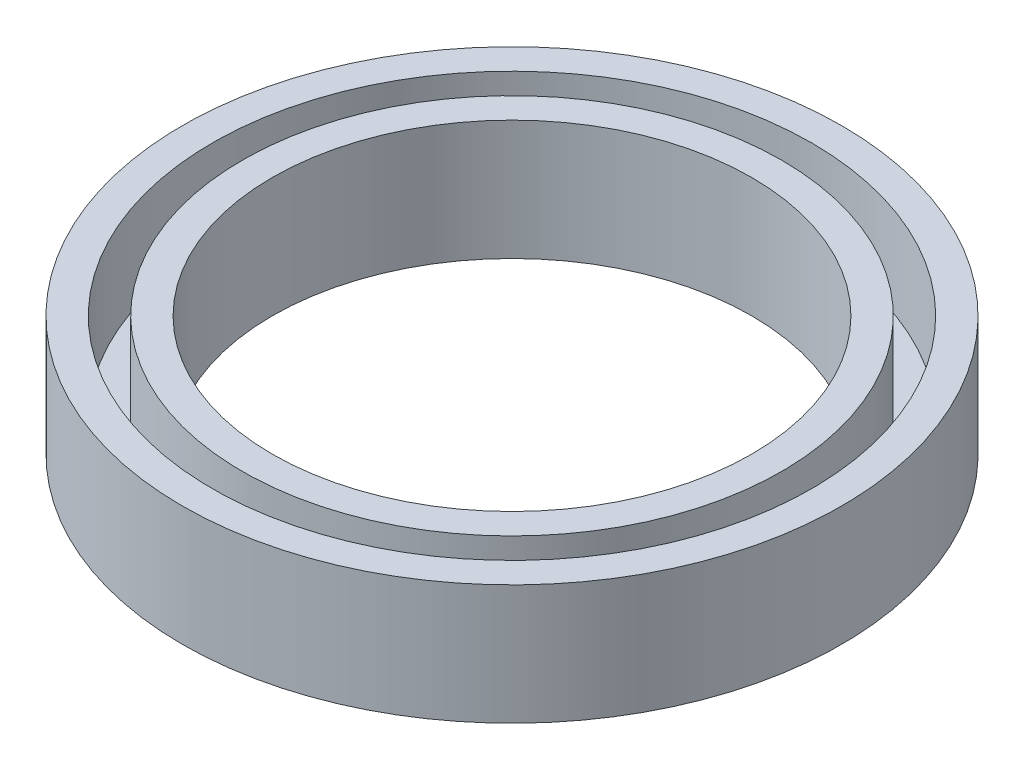
ISO-10303-21;
HEADER;
FILE_DESCRIPTION(('STEP AP214'),'2;1');
FILE_NAME('part.step','',(''),(''),'','','');
FILE_SCHEMA(('AUTOMOTIVE_DESIGN { 1 0 10303 214 1 1 1 1 }'));
ENDSEC;
DATA;
#1=APPLICATION_CONTEXT('core data for automotive mechanical design processes');
#2=APPLICATION_PROTOCOL_DEFINITION('international standard','automotive_design',2000,#1);
#3=PRODUCT_CONTEXT('',#1,'mechanical');
#4=PRODUCT('Part','Part','',(#3));
#5=PRODUCT_RELATED_PRODUCT_CATEGORY('part','',(#4));
#6=PRODUCT_DEFINITION_FORMATION('','',#4);
#7=PRODUCT_DEFINITION_CONTEXT('part definition',#1,'design');
#8=PRODUCT_DEFINITION('design','',#6,#7);
#9=PRODUCT_DEFINITION_SHAPE('','',#8);
#10=(LENGTH_UNIT() NAMED_UNIT(*) SI_UNIT(.MILLI.,.METRE.));
#11=(NAMED_UNIT(*) PLANE_ANGLE_UNIT() SI_UNIT($,.RADIAN.));
#12=(NAMED_UNIT(*) SI_UNIT($,.STERADIAN.) SOLID_ANGLE_UNIT());
#13=UNCERTAINTY_MEASURE_WITH_UNIT(LENGTH_MEASURE(1.E-05),#10,'distance_accuracy_value','');
#14=(GEOMETRIC_REPRESENTATION_CONTEXT(3) GLOBAL_UNCERTAINTY_ASSIGNED_CONTEXT((#13)) GLOBAL_UNIT_ASSIGNED_CONTEXT((#10,
#11,#12)) REPRESENTATION_CONTEXT('',''));
#15=CARTESIAN_POINT('',(0.,0.,0.));
#16=DIRECTION('',(0.,0.,1.));
#17=DIRECTION('',(1.,0.,0.));
#18=AXIS2_PLACEMENT_3D('',#15,#16,#17);
#19=CARTESIAN_POINT('',(-7.9375,3.175,0.));
#20=DIRECTION('',(0.,-1.,0.));
#21=DIRECTION('',(0.,0.,-1.));
#22=AXIS2_PLACEMENT_3D('',#19,#20,#21);
#23=PLANE('',#22);
#24=CARTESIAN_POINT('',(0.,3.175,0.));
#25=DIRECTION('',(0.,-1.,0.));
#26=DIRECTION('',(0.,0.,-1.));
#27=AXIS2_PLACEMENT_3D('',#24,#25,#26);
#28=CIRCLE('',#27,8.73125);
#29=CARTESIAN_POINT('',(0.,3.175,-8.73125));
#30=VERTEX_POINT('',#29);
#31=EDGE_CURVE('E10',#30,#30,#28,.T.);
#32=ORIENTED_EDGE('',*,*,#31,.F.);
#33=EDGE_LOOP('',(#32));
#34=FACE_BOUND('',#33,.T.);
#35=CARTESIAN_POINT('',(0.,3.175,0.));
#36=DIRECTION('',(0.,-1.,0.));
#37=DIRECTION('',(0.,0.,-1.));
#38=AXIS2_PLACEMENT_3D('',#35,#36,#37);
#39=CIRCLE('',#38,7.9375);
#40=CARTESIAN_POINT('',(0.,3.175,-7.9375));
#41=VERTEX_POINT('',#40);
#42=EDGE_CURVE('E59',#41,#41,#39,.T.);
#43=ORIENTED_EDGE('',*,*,#42,.T.);
#44=EDGE_LOOP('',(#43));
#45=FACE_BOUND('',#44,.T.);
#46=ADVANCED_FACE('F31',(#34,#45),#23,.F.);
#47=CARTESIAN_POINT('',(0.,0.,0.));
#48=DIRECTION('',(0.,-1.,0.));
#49=DIRECTION('',(0.,0.,-1.));
#50=AXIS2_PLACEMENT_3D('',#47,#48,#49);
#51=CYLINDRICAL_SURFACE('',#50,8.73125);
#52=CARTESIAN_POINT('',(0.,0.,0.));
#53=DIRECTION('',(0.,-1.,0.));
#54=DIRECTION('',(0.,0.,-1.));
#55=AXIS2_PLACEMENT_3D('',#52,#53,#54);
#56=CIRCLE('',#55,8.73125);
#57=CARTESIAN_POINT('',(0.,0.,-8.73125));
#58=VERTEX_POINT('',#57);
#59=EDGE_CURVE('E37',#58,#58,#56,.T.);
#60=ORIENTED_EDGE('',*,*,#59,.F.);
#61=EDGE_LOOP('',(#60));
#62=FACE_BOUND('',#61,.T.);
#63=ORIENTED_EDGE('',*,*,#31,.T.);
#64=EDGE_LOOP('',(#63));
#65=FACE_BOUND('',#64,.T.);
#66=ADVANCED_FACE('F96',(#62,#65),#51,.T.);
#67=CARTESIAN_POINT('',(-8.73125,0.,0.));
#68=DIRECTION('',(0.,1.,0.));
#69=DIRECTION('',(0.,0.,1.));
#70=AXIS2_PLACEMENT_3D('',#67,#68,#69);
#71=PLANE('',#70);
#72=CARTESIAN_POINT('',(0.,0.,0.));
#73=DIRECTION('',(0.,-1.,0.));
#74=DIRECTION('',(0.,0.,-1.));
#75=AXIS2_PLACEMENT_3D('',#72,#73,#74);
#76=CIRCLE('',#75,6.35);
#77=CARTESIAN_POINT('',(0.,0.,-6.35));
#78=VERTEX_POINT('',#77);
#79=EDGE_CURVE('E41',#78,#78,#76,.T.);
#80=ORIENTED_EDGE('',*,*,#79,.F.);
#81=EDGE_LOOP('',(#80));
#82=FACE_BOUND('',#81,.T.);
#83=ORIENTED_EDGE('',*,*,#59,.T.);
#84=EDGE_LOOP('',(#83));
#85=FACE_BOUND('',#84,.T.);
#86=ADVANCED_FACE('F91',(#82,#85),#71,.F.);
#87=CARTESIAN_POINT('',(0.,0.,0.));
#88=DIRECTION('',(0.,-1.,0.));
#89=DIRECTION('',(0.,0.,-1.));
#90=AXIS2_PLACEMENT_3D('',#87,#88,#89);
#91=CYLINDRICAL_SURFACE('',#90,6.35);
#92=CARTESIAN_POINT('',(0.,3.175,0.));
#93=DIRECTION('',(0.,-1.,0.));
#94=DIRECTION('',(0.,0.,-1.));
#95=AXIS2_PLACEMENT_3D('',#92,#93,#94);
#96=CIRCLE('',#95,6.35);
#97=CARTESIAN_POINT('',(0.,3.175,-6.35));
#98=VERTEX_POINT('',#97);
#99=EDGE_CURVE('E45',#98,#98,#96,.T.);
#100=ORIENTED_EDGE('',*,*,#99,.F.);
#101=EDGE_LOOP('',(#100));
#102=FACE_BOUND('',#101,.T.);
#103=ORIENTED_EDGE('',*,*,#79,.T.);
#104=EDGE_LOOP('',(#103));
#105=FACE_BOUND('',#104,.T.);
#106=ADVANCED_FACE('F85',(#102,#105),#91,.F.);
#107=CARTESIAN_POINT('',(-6.35,3.175,0.));
#108=DIRECTION('',(0.,-1.,0.));
#109=DIRECTION('',(0.,0.,-1.));
#110=AXIS2_PLACEMENT_3D('',#107,#108,#109);
#111=PLANE('',#110);
#112=CARTESIAN_POINT('',(0.,3.175,0.));
#113=DIRECTION('',(0.,-1.,0.));
#114=DIRECTION('',(0.,0.,-1.));
#115=AXIS2_PLACEMENT_3D('',#112,#113,#114);
#116=CIRCLE('',#115,7.14375);
#117=CARTESIAN_POINT('',(0.,3.175,-7.14375));
#118=VERTEX_POINT('',#117);
#119=EDGE_CURVE('E50',#118,#118,#116,.T.);
#120=ORIENTED_EDGE('',*,*,#119,.F.);
#121=EDGE_LOOP('',(#120));
#122=FACE_BOUND('',#121,.T.);
#123=ORIENTED_EDGE('',*,*,#99,.T.);
#124=EDGE_LOOP('',(#123));
#125=FACE_BOUND('',#124,.T.);
#126=ADVANCED_FACE('F79',(#122,#125),#111,.F.);
#127=CARTESIAN_POINT('',(0.,0.,0.));
#128=DIRECTION('',(0.,-1.,0.));
#129=DIRECTION('',(0.,0.,-1.));
#130=AXIS2_PLACEMENT_3D('',#127,#128,#129);
#131=CYLINDRICAL_SURFACE('',#130,7.14375);
#132=CARTESIAN_POINT('',(0.,0.79375,0.));
#133=DIRECTION('',(0.,-1.,0.));
#134=DIRECTION('',(0.,0.,-1.));
#135=AXIS2_PLACEMENT_3D('',#132,#133,#134);
#136=CIRCLE('',#135,7.14375);
#137=CARTESIAN_POINT('',(0.,0.79375,-7.14375));
#138=VERTEX_POINT('',#137);
#139=EDGE_CURVE('E53',#138,#138,#136,.T.);
#140=ORIENTED_EDGE('',*,*,#139,.F.);
#141=EDGE_LOOP('',(#140));
#142=FACE_BOUND('',#141,.T.);
#143=ORIENTED_EDGE('',*,*,#119,.T.);
#144=EDGE_LOOP('',(#143));
#145=FACE_BOUND('',#144,.T.);
#146=ADVANCED_FACE('F73',(#142,#145),#131,.T.);
#147=CARTESIAN_POINT('',(-7.14375,0.79375,0.));
#148=DIRECTION('',(0.,-1.,0.));
#149=DIRECTION('',(0.,0.,-1.));
#150=AXIS2_PLACEMENT_3D('',#147,#148,#149);
#151=PLANE('',#150);
#152=CARTESIAN_POINT('',(0.,0.79375,0.));
#153=DIRECTION('',(0.,-1.,0.));
#154=DIRECTION('',(0.,0.,-1.));
#155=AXIS2_PLACEMENT_3D('',#152,#153,#154);
#156=CIRCLE('',#155,7.9375);
#157=CARTESIAN_POINT('',(0.,0.79375,-7.9375));
#158=VERTEX_POINT('',#157);
#159=EDGE_CURVE('E56',#158,#158,#156,.T.);
#160=ORIENTED_EDGE('',*,*,#159,.F.);
#161=EDGE_LOOP('',(#160));
#162=FACE_BOUND('',#161,.T.);
#163=ORIENTED_EDGE('',*,*,#139,.T.);
#164=EDGE_LOOP('',(#163));
#165=FACE_BOUND('',#164,.T.);
#166=ADVANCED_FACE('F67',(#162,#165),#151,.F.);
#167=CARTESIAN_POINT('',(0.,0.,0.));
#168=DIRECTION('',(0.,-1.,0.));
#169=DIRECTION('',(0.,0.,-1.));
#170=AXIS2_PLACEMENT_3D('',#167,#168,#169);
#171=CYLINDRICAL_SURFACE('',#170,7.9375);
#172=ORIENTED_EDGE('',*,*,#42,.F.);
#173=EDGE_LOOP('',(#172));
#174=FACE_BOUND('',#173,.T.);
#175=ORIENTED_EDGE('',*,*,#159,.T.);
#176=EDGE_LOOP('',(#175));
#177=FACE_BOUND('',#176,.T.);
#178=ADVANCED_FACE('F64',(#174,#177),#171,.F.);
#179=CLOSED_SHELL('',(#46,#66,#86,#106,#126,#146,#166,#178));
#180=MANIFOLD_SOLID_BREP('B2',#179);
#181=ADVANCED_BREP_SHAPE_REPRESENTATION('',(#18,#180),#14);
#182=SHAPE_DEFINITION_REPRESENTATION(#9,#181);
ENDSEC;
END-ISO-10303-21;
